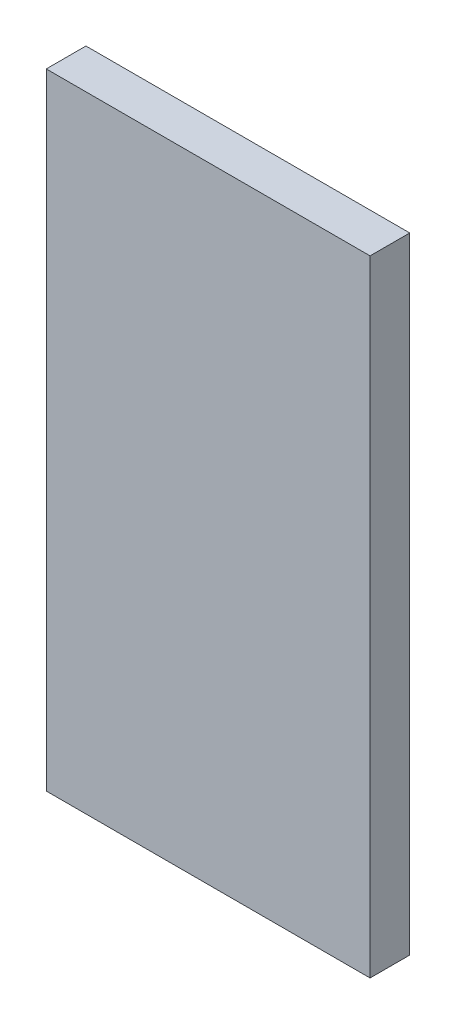
ISO-10303-21;
HEADER;
FILE_DESCRIPTION(('STEP AP214'),'2;1');
FILE_NAME('part.step','',(''),(''),'','','');
FILE_SCHEMA(('AUTOMOTIVE_DESIGN { 1 0 10303 214 1 1 1 1 }'));
ENDSEC;
DATA;
#1=APPLICATION_CONTEXT('core data for automotive mechanical design processes');
#2=APPLICATION_PROTOCOL_DEFINITION('international standard','automotive_design',2000,#1);
#3=PRODUCT_CONTEXT('',#1,'mechanical');
#4=PRODUCT('Part','Part','',(#3));
#5=PRODUCT_RELATED_PRODUCT_CATEGORY('part','',(#4));
#6=PRODUCT_DEFINITION_FORMATION('','',#4);
#7=PRODUCT_DEFINITION_CONTEXT('part definition',#1,'design');
#8=PRODUCT_DEFINITION('design','',#6,#7);
#9=PRODUCT_DEFINITION_SHAPE('','',#8);
#10=(LENGTH_UNIT() NAMED_UNIT(*) SI_UNIT(.MILLI.,.METRE.));
#11=(NAMED_UNIT(*) PLANE_ANGLE_UNIT() SI_UNIT($,.RADIAN.));
#12=(NAMED_UNIT(*) SI_UNIT($,.STERADIAN.) SOLID_ANGLE_UNIT());
#13=UNCERTAINTY_MEASURE_WITH_UNIT(LENGTH_MEASURE(1.E-05),#10,'distance_accuracy_value','');
#14=(GEOMETRIC_REPRESENTATION_CONTEXT(3) GLOBAL_UNCERTAINTY_ASSIGNED_CONTEXT((#13)) GLOBAL_UNIT_ASSIGNED_CONTEXT((#10,
#11,#12)) REPRESENTATION_CONTEXT('',''));
#15=CARTESIAN_POINT('',(0.,0.,0.));
#16=DIRECTION('',(0.,0.,1.));
#17=DIRECTION('',(1.,0.,0.));
#18=AXIS2_PLACEMENT_3D('',#15,#16,#17);
#19=CARTESIAN_POINT('',(-0.408,-3.698,0.1));
#20=DIRECTION('',(0.,0.,1.));
#21=DIRECTION('',(1.,0.,0.));
#22=AXIS2_PLACEMENT_3D('',#19,#20,#21);
#23=PLANE('',#22);
#24=DIRECTION('',(0.,1.,0.));
#25=VECTOR('',#24,1.);
#26=CARTESIAN_POINT('',(0.408,-3.698,0.1));
#27=LINE('',#26,#25);
#28=CARTESIAN_POINT('',(0.408,-2.122,0.1));
#29=VERTEX_POINT('',#28);
#30=CARTESIAN_POINT('',(0.408,-3.698,0.1));
#31=VERTEX_POINT('',#30);
#32=EDGE_CURVE('E75',#29,#31,#27,.F.);
#33=ORIENTED_EDGE('',*,*,#32,.F.);
#34=DIRECTION('',(1.,0.,0.));
#35=VECTOR('',#34,1.);
#36=CARTESIAN_POINT('',(-0.408,-2.122,0.1));
#37=LINE('',#36,#35);
#38=CARTESIAN_POINT('',(-0.408,-2.122,0.1));
#39=VERTEX_POINT('',#38);
#40=EDGE_CURVE('E57',#39,#29,#37,.T.);
#41=ORIENTED_EDGE('',*,*,#40,.F.);
#42=DIRECTION('',(0.,1.,0.));
#43=VECTOR('',#42,1.);
#44=CARTESIAN_POINT('',(-0.408,-3.698,0.1));
#45=LINE('',#44,#43);
#46=CARTESIAN_POINT('',(-0.408,-3.698,0.1));
#47=VERTEX_POINT('',#46);
#48=EDGE_CURVE('E19',#39,#47,#45,.F.);
#49=ORIENTED_EDGE('',*,*,#48,.T.);
#50=DIRECTION('',(1.,0.,0.));
#51=VECTOR('',#50,1.);
#52=CARTESIAN_POINT('',(-0.408,-3.698,0.1));
#53=LINE('',#52,#51);
#54=EDGE_CURVE('E54',#47,#31,#53,.T.);
#55=ORIENTED_EDGE('',*,*,#54,.T.);
#56=EDGE_LOOP('',(#33,#41,#49,#55));
#57=FACE_BOUND('',#56,.T.);
#58=ADVANCED_FACE('F16',(#57),#23,.T.);
#59=CARTESIAN_POINT('',(-0.408,-3.698,0.));
#60=DIRECTION('',(1.,0.,0.));
#61=DIRECTION('',(0.,0.,-1.));
#62=AXIS2_PLACEMENT_3D('',#59,#60,#61);
#63=PLANE('',#62);
#64=DIRECTION('',(0.,0.,1.));
#65=VECTOR('',#64,1.);
#66=CARTESIAN_POINT('',(-0.408,-2.122,0.));
#67=LINE('',#66,#65);
#68=CARTESIAN_POINT('',(-0.408,-2.122,0.));
#69=VERTEX_POINT('',#68);
#70=EDGE_CURVE('E77',#69,#39,#67,.T.);
#71=ORIENTED_EDGE('',*,*,#70,.F.);
#72=DIRECTION('',(0.,1.,0.));
#73=VECTOR('',#72,1.);
#74=CARTESIAN_POINT('',(-0.408,-3.698,0.));
#75=LINE('',#74,#73);
#76=CARTESIAN_POINT('',(-0.408,-3.698,0.));
#77=VERTEX_POINT('',#76);
#78=EDGE_CURVE('E72',#69,#77,#75,.F.);
#79=ORIENTED_EDGE('',*,*,#78,.T.);
#80=DIRECTION('',(0.,0.,1.));
#81=VECTOR('',#80,1.);
#82=CARTESIAN_POINT('',(-0.408,-3.698,0.));
#83=LINE('',#82,#81);
#84=EDGE_CURVE('E62',#77,#47,#83,.T.);
#85=ORIENTED_EDGE('',*,*,#84,.T.);
#86=ORIENTED_EDGE('',*,*,#48,.F.);
#87=EDGE_LOOP('',(#71,#79,#85,#86));
#88=FACE_BOUND('',#87,.T.);
#89=ADVANCED_FACE('F71',(#88),#63,.F.);
#90=CARTESIAN_POINT('',(-0.408,-3.698,0.));
#91=DIRECTION('',(0.,1.,0.));
#92=DIRECTION('',(0.,0.,1.));
#93=AXIS2_PLACEMENT_3D('',#90,#91,#92);
#94=PLANE('',#93);
#95=ORIENTED_EDGE('',*,*,#54,.F.);
#96=ORIENTED_EDGE('',*,*,#84,.F.);
#97=DIRECTION('',(1.,0.,0.));
#98=VECTOR('',#97,1.);
#99=CARTESIAN_POINT('',(-0.408,-3.698,0.));
#100=LINE('',#99,#98);
#101=CARTESIAN_POINT('',(0.408,-3.698,0.));
#102=VERTEX_POINT('',#101);
#103=EDGE_CURVE('E82',#77,#102,#100,.T.);
#104=ORIENTED_EDGE('',*,*,#103,.T.);
#105=DIRECTION('',(0.,0.,-1.));
#106=VECTOR('',#105,1.);
#107=CARTESIAN_POINT('',(0.408,-3.698,0.));
#108=LINE('',#107,#106);
#109=EDGE_CURVE('E68',#31,#102,#108,.T.);
#110=ORIENTED_EDGE('',*,*,#109,.F.);
#111=EDGE_LOOP('',(#95,#96,#104,#110));
#112=FACE_BOUND('',#111,.T.);
#113=ADVANCED_FACE('F65',(#112),#94,.F.);
#114=CARTESIAN_POINT('',(0.408,-3.698,0.));
#115=DIRECTION('',(1.,0.,0.));
#116=DIRECTION('',(0.,0.,-1.));
#117=AXIS2_PLACEMENT_3D('',#114,#115,#116);
#118=PLANE('',#117);
#119=DIRECTION('',(0.,0.,1.));
#120=VECTOR('',#119,1.);
#121=CARTESIAN_POINT('',(0.408,-2.122,0.));
#122=LINE('',#121,#120);
#123=CARTESIAN_POINT('',(0.408,-2.122,0.));
#124=VERTEX_POINT('',#123);
#125=EDGE_CURVE('E33',#29,#124,#122,.F.);
#126=ORIENTED_EDGE('',*,*,#125,.F.);
#127=ORIENTED_EDGE('',*,*,#32,.T.);
#128=ORIENTED_EDGE('',*,*,#109,.T.);
#129=DIRECTION('',(0.,1.,0.));
#130=VECTOR('',#129,1.);
#131=CARTESIAN_POINT('',(0.408,-3.698,0.));
#132=LINE('',#131,#130);
#133=EDGE_CURVE('E25',#102,#124,#132,.T.);
#134=ORIENTED_EDGE('',*,*,#133,.T.);
#135=EDGE_LOOP('',(#126,#127,#128,#134));
#136=FACE_BOUND('',#135,.T.);
#137=ADVANCED_FACE('F87',(#136),#118,.T.);
#138=CARTESIAN_POINT('',(-0.408,-2.122,0.));
#139=DIRECTION('',(0.,1.,0.));
#140=DIRECTION('',(0.,0.,1.));
#141=AXIS2_PLACEMENT_3D('',#138,#139,#140);
#142=PLANE('',#141);
#143=ORIENTED_EDGE('',*,*,#40,.T.);
#144=ORIENTED_EDGE('',*,*,#125,.T.);
#145=DIRECTION('',(1.,0.,0.));
#146=VECTOR('',#145,1.);
#147=CARTESIAN_POINT('',(-0.408,-2.122,0.));
#148=LINE('',#147,#146);
#149=EDGE_CURVE('E11',#124,#69,#148,.F.);
#150=ORIENTED_EDGE('',*,*,#149,.T.);
#151=ORIENTED_EDGE('',*,*,#70,.T.);
#152=EDGE_LOOP('',(#143,#144,#150,#151));
#153=FACE_BOUND('',#152,.T.);
#154=ADVANCED_FACE('F90',(#153),#142,.T.);
#155=CARTESIAN_POINT('',(-0.408,-3.698,0.));
#156=DIRECTION('',(0.,0.,1.));
#157=DIRECTION('',(1.,0.,0.));
#158=AXIS2_PLACEMENT_3D('',#155,#156,#157);
#159=PLANE('',#158);
#160=ORIENTED_EDGE('',*,*,#133,.F.);
#161=ORIENTED_EDGE('',*,*,#103,.F.);
#162=ORIENTED_EDGE('',*,*,#78,.F.);
#163=ORIENTED_EDGE('',*,*,#149,.F.);
#164=EDGE_LOOP('',(#160,#161,#162,#163));
#165=FACE_BOUND('',#164,.T.);
#166=ADVANCED_FACE('F89',(#165),#159,.F.);
#167=CLOSED_SHELL('',(#58,#89,#113,#137,#154,#166));
#168=MANIFOLD_SOLID_BREP('B1',#167);
#169=ADVANCED_BREP_SHAPE_REPRESENTATION('',(#18,#168),#14);
#170=SHAPE_DEFINITION_REPRESENTATION(#9,#169);
ENDSEC;
END-ISO-10303-21;
